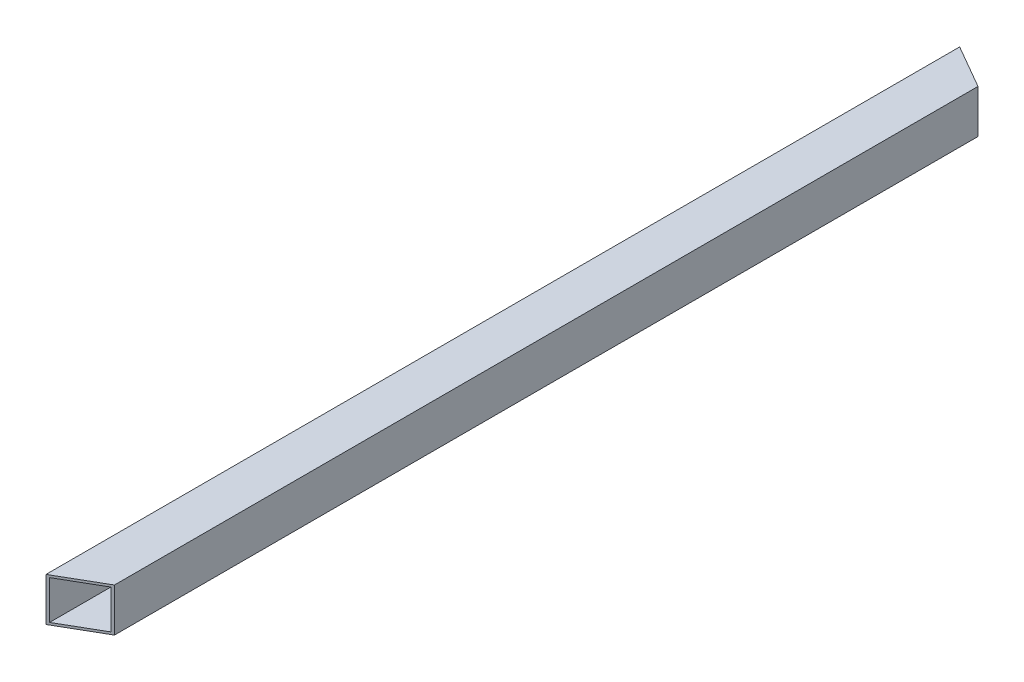
ISO-10303-21;
HEADER;
FILE_DESCRIPTION(('STEP AP214'),'2;1');
FILE_NAME('part.step','',(''),(''),'','','');
FILE_SCHEMA(('AUTOMOTIVE_DESIGN { 1 0 10303 214 1 1 1 1 }'));
ENDSEC;
DATA;
#1=APPLICATION_CONTEXT('core data for automotive mechanical design processes');
#2=APPLICATION_PROTOCOL_DEFINITION('international standard','automotive_design',2000,#1);
#3=PRODUCT_CONTEXT('',#1,'mechanical');
#4=PRODUCT('Part','Part','',(#3));
#5=PRODUCT_RELATED_PRODUCT_CATEGORY('part','',(#4));
#6=PRODUCT_DEFINITION_FORMATION('','',#4);
#7=PRODUCT_DEFINITION_CONTEXT('part definition',#1,'design');
#8=PRODUCT_DEFINITION('design','',#6,#7);
#9=PRODUCT_DEFINITION_SHAPE('','',#8);
#10=(LENGTH_UNIT() NAMED_UNIT(*) SI_UNIT(.MILLI.,.METRE.));
#11=(NAMED_UNIT(*) PLANE_ANGLE_UNIT() SI_UNIT($,.RADIAN.));
#12=(NAMED_UNIT(*) SI_UNIT($,.STERADIAN.) SOLID_ANGLE_UNIT());
#13=UNCERTAINTY_MEASURE_WITH_UNIT(LENGTH_MEASURE(1.E-05),#10,'distance_accuracy_value','');
#14=(GEOMETRIC_REPRESENTATION_CONTEXT(3) GLOBAL_UNCERTAINTY_ASSIGNED_CONTEXT((#13)) GLOBAL_UNIT_ASSIGNED_CONTEXT((#10,
#11,#12)) REPRESENTATION_CONTEXT('',''));
#15=CARTESIAN_POINT('',(0.,0.,0.));
#16=DIRECTION('',(0.,0.,1.));
#17=DIRECTION('',(1.,0.,0.));
#18=AXIS2_PLACEMENT_3D('',#15,#16,#17);
#19=CARTESIAN_POINT('',(9.5,9.5,400.));
#20=DIRECTION('',(-1.,0.,0.));
#21=DIRECTION('',(0.,0.,1.));
#22=AXIS2_PLACEMENT_3D('',#19,#20,#21);
#23=PLANE('',#22);
#24=DIRECTION('',(0.,1.,0.));
#25=VECTOR('',#24,1.);
#26=CARTESIAN_POINT('',(9.5,-534.376855197364,389.030344885397));
#27=LINE('',#26,#25);
#28=CARTESIAN_POINT('',(9.5,-9.49999999999995,389.030344885397));
#29=VERTEX_POINT('',#28);
#30=CARTESIAN_POINT('',(9.50000000000001,9.5,389.030344885397));
#31=VERTEX_POINT('',#30);
#32=EDGE_CURVE('E115',#29,#31,#27,.T.);
#33=ORIENTED_EDGE('',*,*,#32,.F.);
#34=DIRECTION('',(0.,0.,-1.));
#35=VECTOR('',#34,1.);
#36=CARTESIAN_POINT('',(9.5,-9.5,400.));
#37=LINE('',#36,#35);
#38=CARTESIAN_POINT('',(9.49999999999999,-9.5,10.969655114603));
#39=VERTEX_POINT('',#38);
#40=EDGE_CURVE('E100',#29,#39,#37,.T.);
#41=ORIENTED_EDGE('',*,*,#40,.T.);
#42=DIRECTION('',(0.,1.,0.));
#43=VECTOR('',#42,1.);
#44=CARTESIAN_POINT('',(9.5,-534.376855197364,10.969655114603));
#45=LINE('',#44,#43);
#46=CARTESIAN_POINT('',(9.5,9.49999999999995,10.969655114603));
#47=VERTEX_POINT('',#46);
#48=EDGE_CURVE('E124',#39,#47,#45,.T.);
#49=ORIENTED_EDGE('',*,*,#48,.T.);
#50=DIRECTION('',(0.,0.,-1.));
#51=VECTOR('',#50,1.);
#52=CARTESIAN_POINT('',(9.5,9.5,400.));
#53=LINE('',#52,#51);
#54=EDGE_CURVE('E116',#31,#47,#53,.T.);
#55=ORIENTED_EDGE('',*,*,#54,.F.);
#56=EDGE_LOOP('',(#33,#41,#49,#55));
#57=FACE_BOUND('',#56,.T.);
#58=ADVANCED_FACE('F38',(#57),#23,.F.);
#59=CARTESIAN_POINT('',(-9.5,9.5,400.));
#60=DIRECTION('',(0.,-1.,0.));
#61=DIRECTION('',(0.,0.,-1.));
#62=AXIS2_PLACEMENT_3D('',#59,#60,#61);
#63=PLANE('',#62);
#64=DIRECTION('',(-0.86602540378444,0.,0.499999999999999));
#65=VECTOR('',#64,1.);
#66=CARTESIAN_POINT('',(-9.5,9.5,400.));
#67=LINE('',#66,#65);
#68=CARTESIAN_POINT('',(-9.5,9.5,400.));
#69=VERTEX_POINT('',#68);
#70=EDGE_CURVE('E52',#31,#69,#67,.T.);
#71=ORIENTED_EDGE('',*,*,#70,.F.);
#72=ORIENTED_EDGE('',*,*,#54,.T.);
#73=DIRECTION('',(-0.866025403784436,0.,-0.500000000000004));
#74=VECTOR('',#73,1.);
#75=CARTESIAN_POINT('',(163.705080756889,9.5,100.000000000002));
#76=LINE('',#75,#74);
#77=CARTESIAN_POINT('',(-9.5,9.49999999999995,0.));
#78=VERTEX_POINT('',#77);
#79=EDGE_CURVE('E141',#47,#78,#76,.T.);
#80=ORIENTED_EDGE('',*,*,#79,.T.);
#81=DIRECTION('',(0.,0.,-1.));
#82=VECTOR('',#81,1.);
#83=CARTESIAN_POINT('',(-9.5,9.5,400.));
#84=LINE('',#83,#82);
#85=EDGE_CURVE('E157',#69,#78,#84,.T.);
#86=ORIENTED_EDGE('',*,*,#85,.F.);
#87=EDGE_LOOP('',(#71,#72,#80,#86));
#88=FACE_BOUND('',#87,.T.);
#89=ADVANCED_FACE('F191',(#88),#63,.F.);
#90=CARTESIAN_POINT('',(-9.5,-9.5,400.));
#91=DIRECTION('',(0.,1.,0.));
#92=DIRECTION('',(0.,0.,1.));
#93=AXIS2_PLACEMENT_3D('',#90,#91,#92);
#94=PLANE('',#93);
#95=DIRECTION('',(0.86602540378444,0.,-0.499999999999999));
#96=VECTOR('',#95,1.);
#97=CARTESIAN_POINT('',(-9.5,-9.5,400.));
#98=LINE('',#97,#96);
#99=CARTESIAN_POINT('',(-9.5,-9.5,400.));
#100=VERTEX_POINT('',#99);
#101=EDGE_CURVE('E105',#100,#29,#98,.T.);
#102=ORIENTED_EDGE('',*,*,#101,.F.);
#103=DIRECTION('',(0.,0.,-1.));
#104=VECTOR('',#103,1.);
#105=CARTESIAN_POINT('',(-9.5,-9.5,400.));
#106=LINE('',#105,#104);
#107=CARTESIAN_POINT('',(-9.5,-9.49999999999995,0.));
#108=VERTEX_POINT('',#107);
#109=EDGE_CURVE('E111',#100,#108,#106,.T.);
#110=ORIENTED_EDGE('',*,*,#109,.T.);
#111=DIRECTION('',(0.866025403784436,0.,0.500000000000004));
#112=VECTOR('',#111,1.);
#113=CARTESIAN_POINT('',(163.705080756889,-9.5,100.000000000002));
#114=LINE('',#113,#112);
#115=EDGE_CURVE('E107',#108,#39,#114,.T.);
#116=ORIENTED_EDGE('',*,*,#115,.T.);
#117=ORIENTED_EDGE('',*,*,#40,.F.);
#118=EDGE_LOOP('',(#102,#110,#116,#117));
#119=FACE_BOUND('',#118,.T.);
#120=ADVANCED_FACE('F102',(#119),#94,.F.);
#121=CARTESIAN_POINT('',(8.5,8.5,400.));
#122=DIRECTION('',(-1.,0.,0.));
#123=DIRECTION('',(0.,0.,1.));
#124=AXIS2_PLACEMENT_3D('',#121,#122,#123);
#125=PLANE('',#124);
#126=DIRECTION('',(0.,0.,-1.));
#127=VECTOR('',#126,1.);
#128=CARTESIAN_POINT('',(8.5,-8.5,400.));
#129=LINE('',#128,#127);
#130=CARTESIAN_POINT('',(8.5,-8.5,389.607695154587));
#131=VERTEX_POINT('',#130);
#132=CARTESIAN_POINT('',(8.50000000000001,-8.5,10.3923048454134));
#133=VERTEX_POINT('',#132);
#134=EDGE_CURVE('E144',#131,#133,#129,.T.);
#135=ORIENTED_EDGE('',*,*,#134,.F.);
#136=DIRECTION('',(0.,1.,0.));
#137=VECTOR('',#136,1.);
#138=CARTESIAN_POINT('',(8.5,8.5,389.607695154587));
#139=LINE('',#138,#137);
#140=CARTESIAN_POINT('',(8.5,8.5,389.607695154587));
#141=VERTEX_POINT('',#140);
#142=EDGE_CURVE('E60',#131,#141,#139,.T.);
#143=ORIENTED_EDGE('',*,*,#142,.T.);
#144=DIRECTION('',(0.,0.,-1.));
#145=VECTOR('',#144,1.);
#146=CARTESIAN_POINT('',(8.5,8.5,400.));
#147=LINE('',#146,#145);
#148=CARTESIAN_POINT('',(8.49999999999999,8.5,10.3923048454134));
#149=VERTEX_POINT('',#148);
#150=EDGE_CURVE('E150',#141,#149,#147,.T.);
#151=ORIENTED_EDGE('',*,*,#150,.T.);
#152=DIRECTION('',(0.,1.,0.));
#153=VECTOR('',#152,1.);
#154=CARTESIAN_POINT('',(8.5,8.5,10.3923048454134));
#155=LINE('',#154,#153);
#156=EDGE_CURVE('E137',#133,#149,#155,.T.);
#157=ORIENTED_EDGE('',*,*,#156,.F.);
#158=EDGE_LOOP('',(#135,#143,#151,#157));
#159=FACE_BOUND('',#158,.T.);
#160=ADVANCED_FACE('F172',(#159),#125,.T.);
#161=CARTESIAN_POINT('',(-8.5,8.5,400.));
#162=DIRECTION('',(0.,-1.,0.));
#163=DIRECTION('',(0.,0.,-1.));
#164=AXIS2_PLACEMENT_3D('',#161,#162,#163);
#165=PLANE('',#164);
#166=ORIENTED_EDGE('',*,*,#150,.F.);
#167=DIRECTION('',(-0.86602540378444,0.,0.499999999999999));
#168=VECTOR('',#167,1.);
#169=CARTESIAN_POINT('',(-8.75,8.5,399.566987298108));
#170=LINE('',#169,#168);
#171=CARTESIAN_POINT('',(-8.5,8.5,399.42264973081));
#172=VERTEX_POINT('',#171);
#173=EDGE_CURVE('E126',#141,#172,#170,.T.);
#174=ORIENTED_EDGE('',*,*,#173,.T.);
#175=DIRECTION('',(0.,0.,-1.));
#176=VECTOR('',#175,1.);
#177=CARTESIAN_POINT('',(-8.5,8.5,400.));
#178=LINE('',#177,#176);
#179=CARTESIAN_POINT('',(-8.5,8.5,0.577350269189647));
#180=VERTEX_POINT('',#179);
#181=EDGE_CURVE('E148',#172,#180,#178,.T.);
#182=ORIENTED_EDGE('',*,*,#181,.T.);
#183=DIRECTION('',(-0.866025403784436,0.,-0.500000000000004));
#184=VECTOR('',#183,1.);
#185=CARTESIAN_POINT('',(164.455080756889,8.5,100.433012701894));
#186=LINE('',#185,#184);
#187=EDGE_CURVE('E134',#149,#180,#186,.T.);
#188=ORIENTED_EDGE('',*,*,#187,.F.);
#189=EDGE_LOOP('',(#166,#174,#182,#188));
#190=FACE_BOUND('',#189,.T.);
#191=ADVANCED_FACE('F177',(#190),#165,.T.);
#192=CARTESIAN_POINT('',(-8.5,8.5,400.));
#193=DIRECTION('',(1.,0.,0.));
#194=DIRECTION('',(0.,0.,-1.));
#195=AXIS2_PLACEMENT_3D('',#192,#193,#194);
#196=PLANE('',#195);
#197=ORIENTED_EDGE('',*,*,#181,.F.);
#198=DIRECTION('',(0.,-1.,0.));
#199=VECTOR('',#198,1.);
#200=CARTESIAN_POINT('',(-8.5,8.5,399.42264973081));
#201=LINE('',#200,#199);
#202=CARTESIAN_POINT('',(-8.5,-8.5,399.42264973081));
#203=VERTEX_POINT('',#202);
#204=EDGE_CURVE('E118',#172,#203,#201,.T.);
#205=ORIENTED_EDGE('',*,*,#204,.T.);
#206=DIRECTION('',(0.,0.,-1.));
#207=VECTOR('',#206,1.);
#208=CARTESIAN_POINT('',(-8.5,-8.5,400.));
#209=LINE('',#208,#207);
#210=CARTESIAN_POINT('',(-8.50000000000002,-8.5,0.577350269189647));
#211=VERTEX_POINT('',#210);
#212=EDGE_CURVE('E146',#203,#211,#209,.T.);
#213=ORIENTED_EDGE('',*,*,#212,.T.);
#214=DIRECTION('',(0.,-1.,0.));
#215=VECTOR('',#214,1.);
#216=CARTESIAN_POINT('',(-8.5,8.5,0.577350269189647));
#217=LINE('',#216,#215);
#218=EDGE_CURVE('E131',#180,#211,#217,.T.);
#219=ORIENTED_EDGE('',*,*,#218,.F.);
#220=EDGE_LOOP('',(#197,#205,#213,#219));
#221=FACE_BOUND('',#220,.T.);
#222=ADVANCED_FACE('F181',(#221),#196,.T.);
#223=CARTESIAN_POINT('',(-8.5,-8.5,400.));
#224=DIRECTION('',(0.,1.,0.));
#225=DIRECTION('',(0.,0.,1.));
#226=AXIS2_PLACEMENT_3D('',#223,#224,#225);
#227=PLANE('',#226);
#228=ORIENTED_EDGE('',*,*,#212,.F.);
#229=DIRECTION('',(0.86602540378444,0.,-0.499999999999999));
#230=VECTOR('',#229,1.);
#231=CARTESIAN_POINT('',(-8.75,-8.5,399.566987298108));
#232=LINE('',#231,#230);
#233=EDGE_CURVE('E11',#203,#131,#232,.T.);
#234=ORIENTED_EDGE('',*,*,#233,.T.);
#235=ORIENTED_EDGE('',*,*,#134,.T.);
#236=DIRECTION('',(0.866025403784436,0.,0.500000000000004));
#237=VECTOR('',#236,1.);
#238=CARTESIAN_POINT('',(164.455080756889,-8.5,100.433012701894));
#239=LINE('',#238,#237);
#240=EDGE_CURVE('E45',#211,#133,#239,.T.);
#241=ORIENTED_EDGE('',*,*,#240,.F.);
#242=EDGE_LOOP('',(#228,#234,#235,#241));
#243=FACE_BOUND('',#242,.T.);
#244=ADVANCED_FACE('F169',(#243),#227,.T.);
#245=CARTESIAN_POINT('',(-9.5,9.5,400.));
#246=DIRECTION('',(1.,0.,0.));
#247=DIRECTION('',(0.,0.,-1.));
#248=AXIS2_PLACEMENT_3D('',#245,#246,#247);
#249=PLANE('',#248);
#250=DIRECTION('',(0.,-1.,0.));
#251=VECTOR('',#250,1.);
#252=CARTESIAN_POINT('',(-9.5,9.5,0.));
#253=LINE('',#252,#251);
#254=EDGE_CURVE('E152',#78,#108,#253,.T.);
#255=ORIENTED_EDGE('',*,*,#254,.T.);
#256=ORIENTED_EDGE('',*,*,#109,.F.);
#257=DIRECTION('',(0.,-1.,0.));
#258=VECTOR('',#257,1.);
#259=CARTESIAN_POINT('',(-9.5,9.5,400.));
#260=LINE('',#259,#258);
#261=EDGE_CURVE('E112',#69,#100,#260,.T.);
#262=ORIENTED_EDGE('',*,*,#261,.F.);
#263=ORIENTED_EDGE('',*,*,#85,.T.);
#264=EDGE_LOOP('',(#255,#256,#262,#263));
#265=FACE_BOUND('',#264,.T.);
#266=ADVANCED_FACE('F188',(#265),#249,.F.);
#267=CARTESIAN_POINT('',(-9.5,-534.376855197364,0.));
#268=DIRECTION('',(-0.500000000000004,0.,0.866025403784436));
#269=DIRECTION('',(0.866025403784436,0.,0.500000000000004));
#270=AXIS2_PLACEMENT_3D('',#267,#268,#269);
#271=PLANE('',#270);
#272=ORIENTED_EDGE('',*,*,#240,.T.);
#273=ORIENTED_EDGE('',*,*,#156,.T.);
#274=ORIENTED_EDGE('',*,*,#187,.T.);
#275=ORIENTED_EDGE('',*,*,#218,.T.);
#276=EDGE_LOOP('',(#272,#273,#274,#275));
#277=FACE_BOUND('',#276,.T.);
#278=ORIENTED_EDGE('',*,*,#79,.F.);
#279=ORIENTED_EDGE('',*,*,#48,.F.);
#280=ORIENTED_EDGE('',*,*,#115,.F.);
#281=ORIENTED_EDGE('',*,*,#254,.F.);
#282=EDGE_LOOP('',(#278,#279,#280,#281));
#283=FACE_BOUND('',#282,.T.);
#284=ADVANCED_FACE('F163',(#277,#283),#271,.F.);
#285=CARTESIAN_POINT('',(-9.5,-534.376855197364,400.));
#286=DIRECTION('',(0.499999999999999,0.,0.866025403784439));
#287=DIRECTION('',(0.86602540378444,0.,-0.499999999999999));
#288=AXIS2_PLACEMENT_3D('',#285,#286,#287);
#289=PLANE('',#288);
#290=ORIENTED_EDGE('',*,*,#142,.F.);
#291=ORIENTED_EDGE('',*,*,#233,.F.);
#292=ORIENTED_EDGE('',*,*,#204,.F.);
#293=ORIENTED_EDGE('',*,*,#173,.F.);
#294=EDGE_LOOP('',(#290,#291,#292,#293));
#295=FACE_BOUND('',#294,.T.);
#296=ORIENTED_EDGE('',*,*,#32,.T.);
#297=ORIENTED_EDGE('',*,*,#70,.T.);
#298=ORIENTED_EDGE('',*,*,#261,.T.);
#299=ORIENTED_EDGE('',*,*,#101,.T.);
#300=EDGE_LOOP('',(#296,#297,#298,#299));
#301=FACE_BOUND('',#300,.T.);
#302=ADVANCED_FACE('F121',(#295,#301),#289,.T.);
#303=CLOSED_SHELL('',(#58,#89,#120,#160,#191,#222,#244,#266,#284,#302));
#304=MANIFOLD_SOLID_BREP('B2',#303);
#305=ADVANCED_BREP_SHAPE_REPRESENTATION('',(#18,#304),#14);
#306=SHAPE_DEFINITION_REPRESENTATION(#9,#305);
ENDSEC;
END-ISO-10303-21;
